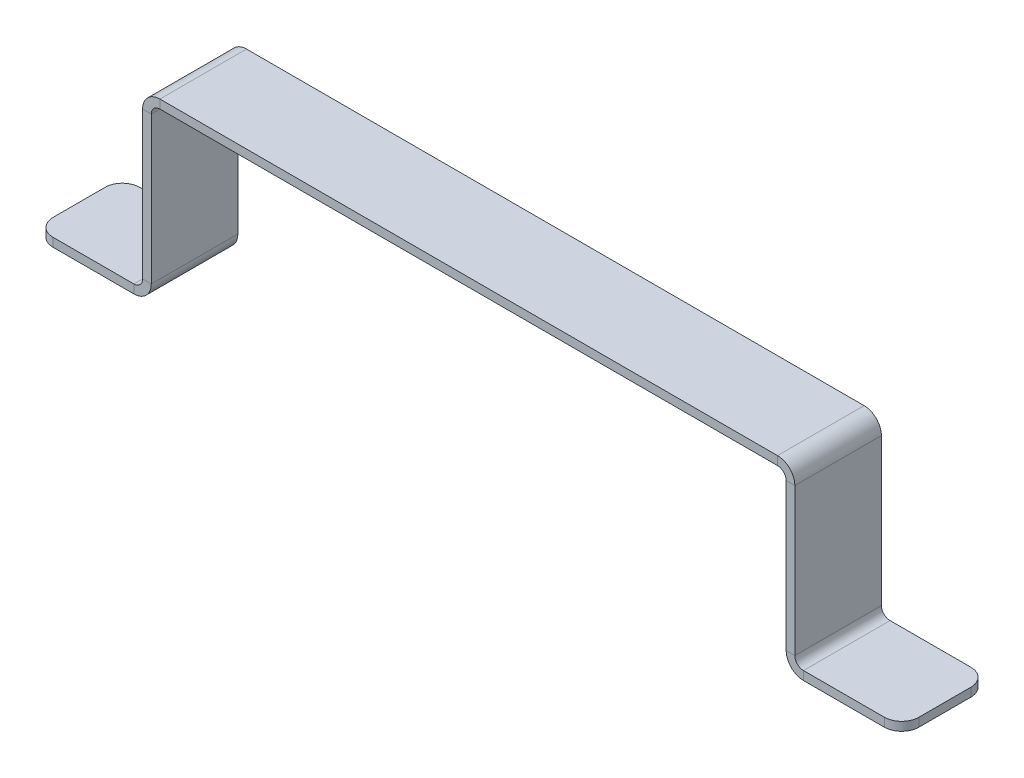
ISO-10303-21;
HEADER;
FILE_DESCRIPTION(('STEP AP214'),'2;1');
FILE_NAME('part.step','',(''),(''),'','','');
FILE_SCHEMA(('AUTOMOTIVE_DESIGN { 1 0 10303 214 1 1 1 1 }'));
ENDSEC;
DATA;
#1=APPLICATION_CONTEXT('core data for automotive mechanical design processes');
#2=APPLICATION_PROTOCOL_DEFINITION('international standard','automotive_design',2000,#1);
#3=PRODUCT_CONTEXT('',#1,'mechanical');
#4=PRODUCT('Part','Part','',(#3));
#5=PRODUCT_RELATED_PRODUCT_CATEGORY('part','',(#4));
#6=PRODUCT_DEFINITION_FORMATION('','',#4);
#7=PRODUCT_DEFINITION_CONTEXT('part definition',#1,'design');
#8=PRODUCT_DEFINITION('design','',#6,#7);
#9=PRODUCT_DEFINITION_SHAPE('','',#8);
#10=(LENGTH_UNIT() NAMED_UNIT(*) SI_UNIT(.MILLI.,.METRE.));
#11=(NAMED_UNIT(*) PLANE_ANGLE_UNIT() SI_UNIT($,.RADIAN.));
#12=(NAMED_UNIT(*) SI_UNIT($,.STERADIAN.) SOLID_ANGLE_UNIT());
#13=UNCERTAINTY_MEASURE_WITH_UNIT(LENGTH_MEASURE(1.E-05),#10,'distance_accuracy_value','');
#14=(GEOMETRIC_REPRESENTATION_CONTEXT(3) GLOBAL_UNCERTAINTY_ASSIGNED_CONTEXT((#13)) GLOBAL_UNIT_ASSIGNED_CONTEXT((#10,
#11,#12)) REPRESENTATION_CONTEXT('',''));
#15=CARTESIAN_POINT('',(0.,0.,0.));
#16=DIRECTION('',(0.,0.,1.));
#17=DIRECTION('',(1.,0.,0.));
#18=AXIS2_PLACEMENT_3D('',#15,#16,#17);
#19=CARTESIAN_POINT('',(-58.,0.,7.5));
#20=DIRECTION('',(0.,0.,1.));
#21=DIRECTION('',(1.,0.,0.));
#22=AXIS2_PLACEMENT_3D('',#19,#20,#21);
#23=PLANE('',#22);
#24=DIRECTION('',(0.,1.,0.));
#25=VECTOR('',#24,1.);
#26=CARTESIAN_POINT('',(-58.,0.,7.5));
#27=LINE('',#26,#25);
#28=CARTESIAN_POINT('',(-58.,0.,7.5));
#29=VERTEX_POINT('',#28);
#30=CARTESIAN_POINT('',(-58.,1.5,7.5));
#31=VERTEX_POINT('',#30);
#32=EDGE_CURVE('E198',#29,#31,#27,.T.);
#33=ORIENTED_EDGE('',*,*,#32,.F.);
#34=CARTESIAN_POINT('',(-58.,3.,7.5));
#35=DIRECTION('',(0.,0.,-1.));
#36=DIRECTION('',(-1.,0.,0.));
#37=AXIS2_PLACEMENT_3D('',#34,#35,#36);
#38=CIRCLE('',#37,3.);
#39=CARTESIAN_POINT('',(-55.,3.,7.5));
#40=VERTEX_POINT('',#39);
#41=EDGE_CURVE('E201',#40,#29,#38,.T.);
#42=ORIENTED_EDGE('',*,*,#41,.F.);
#43=DIRECTION('',(1.,0.,0.));
#44=VECTOR('',#43,1.);
#45=CARTESIAN_POINT('',(-56.5,3.,7.5));
#46=LINE('',#45,#44);
#47=CARTESIAN_POINT('',(-56.5,3.,7.5));
#48=VERTEX_POINT('',#47);
#49=EDGE_CURVE('E207',#48,#40,#46,.T.);
#50=ORIENTED_EDGE('',*,*,#49,.F.);
#51=CARTESIAN_POINT('',(-58.,3.,7.5));
#52=DIRECTION('',(0.,0.,1.));
#53=DIRECTION('',(1.,0.,0.));
#54=AXIS2_PLACEMENT_3D('',#51,#52,#53);
#55=CIRCLE('',#54,1.5);
#56=EDGE_CURVE('E204',#48,#31,#55,.F.);
#57=ORIENTED_EDGE('',*,*,#56,.T.);
#58=EDGE_LOOP('',(#33,#42,#50,#57));
#59=FACE_BOUND('',#58,.T.);
#60=ADVANCED_FACE('F35',(#59),#23,.T.);
#61=CARTESIAN_POINT('',(-56.5,3.,7.5));
#62=DIRECTION('',(0.,0.,1.));
#63=DIRECTION('',(1.,0.,0.));
#64=AXIS2_PLACEMENT_3D('',#61,#62,#63);
#65=PLANE('',#64);
#66=DIRECTION('',(1.,0.,0.));
#67=VECTOR('',#66,1.);
#68=CARTESIAN_POINT('',(-75.,1.5,7.5));
#69=LINE('',#68,#67);
#70=CARTESIAN_POINT('',(-72.,1.5,7.5));
#71=VERTEX_POINT('',#70);
#72=EDGE_CURVE('E225',#31,#71,#69,.F.);
#73=ORIENTED_EDGE('',*,*,#72,.T.);
#74=DIRECTION('',(0.,1.,0.));
#75=VECTOR('',#74,1.);
#76=CARTESIAN_POINT('',(-72.,3.,7.5));
#77=LINE('',#76,#75);
#78=CARTESIAN_POINT('',(-72.,0.,7.5));
#79=VERTEX_POINT('',#78);
#80=EDGE_CURVE('E11',#71,#79,#77,.F.);
#81=ORIENTED_EDGE('',*,*,#80,.T.);
#82=DIRECTION('',(-1.,0.,0.));
#83=VECTOR('',#82,1.);
#84=CARTESIAN_POINT('',(-75.,0.,7.5));
#85=LINE('',#84,#83);
#86=EDGE_CURVE('E214',#29,#79,#85,.T.);
#87=ORIENTED_EDGE('',*,*,#86,.F.);
#88=ORIENTED_EDGE('',*,*,#32,.T.);
#89=EDGE_LOOP('',(#73,#81,#87,#88));
#90=FACE_BOUND('',#89,.T.);
#91=ADVANCED_FACE('F224',(#90),#65,.T.);
#92=CARTESIAN_POINT('',(-55.,3.,-7.5));
#93=DIRECTION('',(0.,0.,-1.));
#94=DIRECTION('',(-1.,0.,0.));
#95=AXIS2_PLACEMENT_3D('',#92,#93,#94);
#96=PLANE('',#95);
#97=DIRECTION('',(-1.,0.,0.));
#98=VECTOR('',#97,1.);
#99=CARTESIAN_POINT('',(-55.,3.,-7.5));
#100=LINE('',#99,#98);
#101=CARTESIAN_POINT('',(-55.,3.,-7.5));
#102=VERTEX_POINT('',#101);
#103=CARTESIAN_POINT('',(-56.5,3.,-7.5));
#104=VERTEX_POINT('',#103);
#105=EDGE_CURVE('E402',#102,#104,#100,.T.);
#106=ORIENTED_EDGE('',*,*,#105,.F.);
#107=CARTESIAN_POINT('',(-58.,3.,-7.5));
#108=DIRECTION('',(0.,0.,-1.));
#109=DIRECTION('',(-1.,0.,0.));
#110=AXIS2_PLACEMENT_3D('',#107,#108,#109);
#111=CIRCLE('',#110,3.);
#112=CARTESIAN_POINT('',(-58.,0.,-7.5));
#113=VERTEX_POINT('',#112);
#114=EDGE_CURVE('E278',#102,#113,#111,.T.);
#115=ORIENTED_EDGE('',*,*,#114,.T.);
#116=DIRECTION('',(0.,-1.,0.));
#117=VECTOR('',#116,1.);
#118=CARTESIAN_POINT('',(-58.,1.5,-7.5));
#119=LINE('',#118,#117);
#120=CARTESIAN_POINT('',(-58.,1.5,-7.5));
#121=VERTEX_POINT('',#120);
#122=EDGE_CURVE('E400',#121,#113,#119,.T.);
#123=ORIENTED_EDGE('',*,*,#122,.F.);
#124=CARTESIAN_POINT('',(-58.,3.,-7.5));
#125=DIRECTION('',(0.,0.,1.));
#126=DIRECTION('',(1.,0.,0.));
#127=AXIS2_PLACEMENT_3D('',#124,#125,#126);
#128=CIRCLE('',#127,1.5);
#129=EDGE_CURVE('E320',#104,#121,#128,.F.);
#130=ORIENTED_EDGE('',*,*,#129,.F.);
#131=EDGE_LOOP('',(#106,#115,#123,#130));
#132=FACE_BOUND('',#131,.T.);
#133=ADVANCED_FACE('F453',(#132),#96,.T.);
#134=CARTESIAN_POINT('',(-58.,1.5,-7.5));
#135=DIRECTION('',(0.,0.,-1.));
#136=DIRECTION('',(-1.,0.,0.));
#137=AXIS2_PLACEMENT_3D('',#134,#135,#136);
#138=PLANE('',#137);
#139=DIRECTION('',(0.,-1.,0.));
#140=VECTOR('',#139,1.);
#141=CARTESIAN_POINT('',(-55.,0.,-7.5));
#142=LINE('',#141,#140);
#143=CARTESIAN_POINT('',(-55.,28.5,-7.5));
#144=VERTEX_POINT('',#143);
#145=EDGE_CURVE('E280',#144,#102,#142,.T.);
#146=ORIENTED_EDGE('',*,*,#145,.T.);
#147=ORIENTED_EDGE('',*,*,#105,.T.);
#148=DIRECTION('',(0.,1.,0.));
#149=VECTOR('',#148,1.);
#150=CARTESIAN_POINT('',(-56.5,0.,-7.5));
#151=LINE('',#150,#149);
#152=CARTESIAN_POINT('',(-56.5,28.5,-7.5));
#153=VERTEX_POINT('',#152);
#154=EDGE_CURVE('E317',#153,#104,#151,.F.);
#155=ORIENTED_EDGE('',*,*,#154,.F.);
#156=DIRECTION('',(1.,0.,0.));
#157=VECTOR('',#156,1.);
#158=CARTESIAN_POINT('',(-56.5,28.5,-7.5));
#159=LINE('',#158,#157);
#160=EDGE_CURVE('E392',#153,#144,#159,.T.);
#161=ORIENTED_EDGE('',*,*,#160,.T.);
#162=EDGE_LOOP('',(#146,#147,#155,#161));
#163=FACE_BOUND('',#162,.T.);
#164=ADVANCED_FACE('F456',(#163),#138,.T.);
#165=CARTESIAN_POINT('',(-55.,28.5,7.5));
#166=DIRECTION('',(0.,0.,1.));
#167=DIRECTION('',(1.,0.,0.));
#168=AXIS2_PLACEMENT_3D('',#165,#166,#167);
#169=PLANE('',#168);
#170=DIRECTION('',(-1.,0.,0.));
#171=VECTOR('',#170,1.);
#172=CARTESIAN_POINT('',(-55.,28.5,7.5));
#173=LINE('',#172,#171);
#174=CARTESIAN_POINT('',(-55.,28.5,7.5));
#175=VERTEX_POINT('',#174);
#176=CARTESIAN_POINT('',(-56.5,28.5,7.5));
#177=VERTEX_POINT('',#176);
#178=EDGE_CURVE('E398',#175,#177,#173,.T.);
#179=ORIENTED_EDGE('',*,*,#178,.F.);
#180=CARTESIAN_POINT('',(-53.5,28.5,7.5));
#181=DIRECTION('',(0.,0.,1.));
#182=DIRECTION('',(1.,0.,0.));
#183=AXIS2_PLACEMENT_3D('',#180,#181,#182);
#184=CIRCLE('',#183,1.5);
#185=CARTESIAN_POINT('',(-53.5,30.,7.5));
#186=VERTEX_POINT('',#185);
#187=EDGE_CURVE('E232',#186,#175,#184,.T.);
#188=ORIENTED_EDGE('',*,*,#187,.F.);
#189=DIRECTION('',(0.,-1.,0.));
#190=VECTOR('',#189,1.);
#191=CARTESIAN_POINT('',(-53.5,31.5,7.5));
#192=LINE('',#191,#190);
#193=CARTESIAN_POINT('',(-53.5,31.5,7.5));
#194=VERTEX_POINT('',#193);
#195=EDGE_CURVE('E396',#194,#186,#192,.T.);
#196=ORIENTED_EDGE('',*,*,#195,.F.);
#197=CARTESIAN_POINT('',(-53.5,28.5,7.5));
#198=DIRECTION('',(0.,0.,1.));
#199=DIRECTION('',(1.,0.,0.));
#200=AXIS2_PLACEMENT_3D('',#197,#198,#199);
#201=CIRCLE('',#200,3.);
#202=EDGE_CURVE('E266',#194,#177,#201,.T.);
#203=ORIENTED_EDGE('',*,*,#202,.T.);
#204=EDGE_LOOP('',(#179,#188,#196,#203));
#205=FACE_BOUND('',#204,.T.);
#206=ADVANCED_FACE('F522',(#205),#169,.T.);
#207=CARTESIAN_POINT('',(-53.5,31.5,7.5));
#208=DIRECTION('',(0.,0.,1.));
#209=DIRECTION('',(1.,0.,0.));
#210=AXIS2_PLACEMENT_3D('',#207,#208,#209);
#211=PLANE('',#210);
#212=DIRECTION('',(0.,-1.,0.));
#213=VECTOR('',#212,1.);
#214=CARTESIAN_POINT('',(-55.,0.,7.5));
#215=LINE('',#214,#213);
#216=EDGE_CURVE('E230',#175,#40,#215,.T.);
#217=ORIENTED_EDGE('',*,*,#216,.F.);
#218=ORIENTED_EDGE('',*,*,#178,.T.);
#219=DIRECTION('',(0.,1.,0.));
#220=VECTOR('',#219,1.);
#221=CARTESIAN_POINT('',(-56.5,0.,7.5));
#222=LINE('',#221,#220);
#223=EDGE_CURVE('E269',#177,#48,#222,.F.);
#224=ORIENTED_EDGE('',*,*,#223,.T.);
#225=ORIENTED_EDGE('',*,*,#49,.T.);
#226=EDGE_LOOP('',(#217,#218,#224,#225));
#227=FACE_BOUND('',#226,.T.);
#228=ADVANCED_FACE('F526',(#227),#211,.T.);
#229=CARTESIAN_POINT('',(-53.5,30.,-7.5));
#230=DIRECTION('',(0.,0.,-1.));
#231=DIRECTION('',(-1.,0.,0.));
#232=AXIS2_PLACEMENT_3D('',#229,#230,#231);
#233=PLANE('',#232);
#234=DIRECTION('',(0.,1.,0.));
#235=VECTOR('',#234,1.);
#236=CARTESIAN_POINT('',(-53.5,30.,-7.5));
#237=LINE('',#236,#235);
#238=CARTESIAN_POINT('',(-53.5,30.,-7.5));
#239=VERTEX_POINT('',#238);
#240=CARTESIAN_POINT('',(-53.5,31.5,-7.5));
#241=VERTEX_POINT('',#240);
#242=EDGE_CURVE('E394',#239,#241,#237,.T.);
#243=ORIENTED_EDGE('',*,*,#242,.F.);
#244=CARTESIAN_POINT('',(-53.5,28.5,-7.5));
#245=DIRECTION('',(0.,0.,1.));
#246=DIRECTION('',(1.,0.,0.));
#247=AXIS2_PLACEMENT_3D('',#244,#245,#246);
#248=CIRCLE('',#247,1.5);
#249=EDGE_CURVE('E283',#239,#144,#248,.T.);
#250=ORIENTED_EDGE('',*,*,#249,.T.);
#251=ORIENTED_EDGE('',*,*,#160,.F.);
#252=CARTESIAN_POINT('',(-53.5,28.5,-7.5));
#253=DIRECTION('',(0.,0.,1.));
#254=DIRECTION('',(1.,0.,0.));
#255=AXIS2_PLACEMENT_3D('',#252,#253,#254);
#256=CIRCLE('',#255,3.);
#257=EDGE_CURVE('E314',#241,#153,#256,.T.);
#258=ORIENTED_EDGE('',*,*,#257,.F.);
#259=EDGE_LOOP('',(#243,#250,#251,#258));
#260=FACE_BOUND('',#259,.T.);
#261=ADVANCED_FACE('F464',(#260),#233,.T.);
#262=CARTESIAN_POINT('',(-56.5,28.5,-7.5));
#263=DIRECTION('',(0.,0.,-1.));
#264=DIRECTION('',(-1.,0.,0.));
#265=AXIS2_PLACEMENT_3D('',#262,#263,#264);
#266=PLANE('',#265);
#267=DIRECTION('',(-1.,0.,0.));
#268=VECTOR('',#267,1.);
#269=CARTESIAN_POINT('',(-55.,30.,-7.5));
#270=LINE('',#269,#268);
#271=CARTESIAN_POINT('',(53.5,30.,-7.5));
#272=VERTEX_POINT('',#271);
#273=EDGE_CURVE('E286',#272,#239,#270,.T.);
#274=ORIENTED_EDGE('',*,*,#273,.T.);
#275=ORIENTED_EDGE('',*,*,#242,.T.);
#276=DIRECTION('',(1.,0.,0.));
#277=VECTOR('',#276,1.);
#278=CARTESIAN_POINT('',(-55.,31.5,-7.5));
#279=LINE('',#278,#277);
#280=CARTESIAN_POINT('',(53.5,31.5,-7.5));
#281=VERTEX_POINT('',#280);
#282=EDGE_CURVE('E311',#281,#241,#279,.F.);
#283=ORIENTED_EDGE('',*,*,#282,.F.);
#284=DIRECTION('',(0.,-1.,0.));
#285=VECTOR('',#284,1.);
#286=CARTESIAN_POINT('',(53.5,31.5,-7.5));
#287=LINE('',#286,#285);
#288=EDGE_CURVE('E384',#281,#272,#287,.T.);
#289=ORIENTED_EDGE('',*,*,#288,.T.);
#290=EDGE_LOOP('',(#274,#275,#283,#289));
#291=FACE_BOUND('',#290,.T.);
#292=ADVANCED_FACE('F472',(#291),#266,.T.);
#293=CARTESIAN_POINT('',(53.5,30.,7.5));
#294=DIRECTION('',(0.,0.,1.));
#295=DIRECTION('',(1.,0.,0.));
#296=AXIS2_PLACEMENT_3D('',#293,#294,#295);
#297=PLANE('',#296);
#298=DIRECTION('',(0.,1.,0.));
#299=VECTOR('',#298,1.);
#300=CARTESIAN_POINT('',(53.5,30.,7.5));
#301=LINE('',#300,#299);
#302=CARTESIAN_POINT('',(53.5,30.,7.5));
#303=VERTEX_POINT('',#302);
#304=CARTESIAN_POINT('',(53.5,31.5,7.5));
#305=VERTEX_POINT('',#304);
#306=EDGE_CURVE('E390',#303,#305,#301,.T.);
#307=ORIENTED_EDGE('',*,*,#306,.F.);
#308=CARTESIAN_POINT('',(53.5,28.5,7.5));
#309=DIRECTION('',(0.,0.,1.));
#310=DIRECTION('',(1.,0.,0.));
#311=AXIS2_PLACEMENT_3D('',#308,#309,#310);
#312=CIRCLE('',#311,1.5);
#313=CARTESIAN_POINT('',(55.,28.5,7.5));
#314=VERTEX_POINT('',#313);
#315=EDGE_CURVE('E241',#314,#303,#312,.T.);
#316=ORIENTED_EDGE('',*,*,#315,.F.);
#317=DIRECTION('',(-1.,0.,0.));
#318=VECTOR('',#317,1.);
#319=CARTESIAN_POINT('',(56.5,28.5,7.5));
#320=LINE('',#319,#318);
#321=CARTESIAN_POINT('',(56.5,28.5,7.5));
#322=VERTEX_POINT('',#321);
#323=EDGE_CURVE('E388',#322,#314,#320,.T.);
#324=ORIENTED_EDGE('',*,*,#323,.F.);
#325=CARTESIAN_POINT('',(53.5,28.5,7.5));
#326=DIRECTION('',(0.,0.,1.));
#327=DIRECTION('',(1.,0.,0.));
#328=AXIS2_PLACEMENT_3D('',#325,#326,#327);
#329=CIRCLE('',#328,3.);
#330=EDGE_CURVE('E260',#322,#305,#329,.T.);
#331=ORIENTED_EDGE('',*,*,#330,.T.);
#332=EDGE_LOOP('',(#307,#316,#324,#331));
#333=FACE_BOUND('',#332,.T.);
#334=ADVANCED_FACE('F514',(#333),#297,.T.);
#335=CARTESIAN_POINT('',(56.5,28.5,7.5));
#336=DIRECTION('',(0.,0.,1.));
#337=DIRECTION('',(1.,0.,0.));
#338=AXIS2_PLACEMENT_3D('',#335,#336,#337);
#339=PLANE('',#338);
#340=DIRECTION('',(-1.,0.,0.));
#341=VECTOR('',#340,1.);
#342=CARTESIAN_POINT('',(-55.,30.,7.5));
#343=LINE('',#342,#341);
#344=EDGE_CURVE('E238',#303,#186,#343,.T.);
#345=ORIENTED_EDGE('',*,*,#344,.F.);
#346=ORIENTED_EDGE('',*,*,#306,.T.);
#347=DIRECTION('',(1.,0.,0.));
#348=VECTOR('',#347,1.);
#349=CARTESIAN_POINT('',(-55.,31.5,7.5));
#350=LINE('',#349,#348);
#351=EDGE_CURVE('E263',#305,#194,#350,.F.);
#352=ORIENTED_EDGE('',*,*,#351,.T.);
#353=ORIENTED_EDGE('',*,*,#195,.T.);
#354=EDGE_LOOP('',(#345,#346,#352,#353));
#355=FACE_BOUND('',#354,.T.);
#356=ADVANCED_FACE('F518',(#355),#339,.T.);
#357=CARTESIAN_POINT('',(55.,28.5,-7.5));
#358=DIRECTION('',(0.,0.,-1.));
#359=DIRECTION('',(-1.,0.,0.));
#360=AXIS2_PLACEMENT_3D('',#357,#358,#359);
#361=PLANE('',#360);
#362=DIRECTION('',(1.,0.,0.));
#363=VECTOR('',#362,1.);
#364=CARTESIAN_POINT('',(55.,28.5,-7.5));
#365=LINE('',#364,#363);
#366=CARTESIAN_POINT('',(55.,28.5,-7.5));
#367=VERTEX_POINT('',#366);
#368=CARTESIAN_POINT('',(56.5,28.5,-7.5));
#369=VERTEX_POINT('',#368);
#370=EDGE_CURVE('E386',#367,#369,#365,.T.);
#371=ORIENTED_EDGE('',*,*,#370,.F.);
#372=CARTESIAN_POINT('',(53.5,28.5,-7.5));
#373=DIRECTION('',(0.,0.,1.));
#374=DIRECTION('',(1.,0.,0.));
#375=AXIS2_PLACEMENT_3D('',#372,#373,#374);
#376=CIRCLE('',#375,1.5);
#377=EDGE_CURVE('E289',#367,#272,#376,.T.);
#378=ORIENTED_EDGE('',*,*,#377,.T.);
#379=ORIENTED_EDGE('',*,*,#288,.F.);
#380=CARTESIAN_POINT('',(53.5,28.5,-7.5));
#381=DIRECTION('',(0.,0.,1.));
#382=DIRECTION('',(1.,0.,0.));
#383=AXIS2_PLACEMENT_3D('',#380,#381,#382);
#384=CIRCLE('',#383,3.);
#385=EDGE_CURVE('E308',#369,#281,#384,.T.);
#386=ORIENTED_EDGE('',*,*,#385,.F.);
#387=EDGE_LOOP('',(#371,#378,#379,#386));
#388=FACE_BOUND('',#387,.T.);
#389=ADVANCED_FACE('F480',(#388),#361,.T.);
#390=CARTESIAN_POINT('',(53.5,31.5,-7.5));
#391=DIRECTION('',(0.,0.,-1.));
#392=DIRECTION('',(-1.,0.,0.));
#393=AXIS2_PLACEMENT_3D('',#390,#391,#392);
#394=PLANE('',#393);
#395=DIRECTION('',(0.,1.,0.));
#396=VECTOR('',#395,1.);
#397=CARTESIAN_POINT('',(55.,0.,-7.5));
#398=LINE('',#397,#396);
#399=CARTESIAN_POINT('',(55.,3.,-7.5));
#400=VERTEX_POINT('',#399);
#401=EDGE_CURVE('E292',#400,#367,#398,.T.);
#402=ORIENTED_EDGE('',*,*,#401,.T.);
#403=ORIENTED_EDGE('',*,*,#370,.T.);
#404=DIRECTION('',(0.,1.,0.));
#405=VECTOR('',#404,1.);
#406=CARTESIAN_POINT('',(56.5,0.,-7.5));
#407=LINE('',#406,#405);
#408=CARTESIAN_POINT('',(56.5,3.,-7.5));
#409=VERTEX_POINT('',#408);
#410=EDGE_CURVE('E305',#409,#369,#407,.T.);
#411=ORIENTED_EDGE('',*,*,#410,.F.);
#412=DIRECTION('',(-1.,0.,0.));
#413=VECTOR('',#412,1.);
#414=CARTESIAN_POINT('',(56.5,3.,-7.5));
#415=LINE('',#414,#413);
#416=EDGE_CURVE('E374',#409,#400,#415,.T.);
#417=ORIENTED_EDGE('',*,*,#416,.T.);
#418=EDGE_LOOP('',(#402,#403,#411,#417));
#419=FACE_BOUND('',#418,.T.);
#420=ADVANCED_FACE('F488',(#419),#394,.T.);
#421=CARTESIAN_POINT('',(55.,3.,7.5));
#422=DIRECTION('',(0.,0.,1.));
#423=DIRECTION('',(1.,0.,0.));
#424=AXIS2_PLACEMENT_3D('',#421,#422,#423);
#425=PLANE('',#424);
#426=DIRECTION('',(1.,0.,0.));
#427=VECTOR('',#426,1.);
#428=CARTESIAN_POINT('',(55.,3.,7.5));
#429=LINE('',#428,#427);
#430=CARTESIAN_POINT('',(55.,3.,7.5));
#431=VERTEX_POINT('',#430);
#432=CARTESIAN_POINT('',(56.5,3.,7.5));
#433=VERTEX_POINT('',#432);
#434=EDGE_CURVE('E382',#431,#433,#429,.T.);
#435=ORIENTED_EDGE('',*,*,#434,.F.);
#436=CARTESIAN_POINT('',(58.,3.,7.5));
#437=DIRECTION('',(0.,0.,-1.));
#438=DIRECTION('',(-1.,0.,0.));
#439=AXIS2_PLACEMENT_3D('',#436,#437,#438);
#440=CIRCLE('',#439,3.);
#441=CARTESIAN_POINT('',(58.,0.,7.5));
#442=VERTEX_POINT('',#441);
#443=EDGE_CURVE('E247',#442,#431,#440,.T.);
#444=ORIENTED_EDGE('',*,*,#443,.F.);
#445=DIRECTION('',(0.,-1.,0.));
#446=VECTOR('',#445,1.);
#447=CARTESIAN_POINT('',(58.,1.5,7.5));
#448=LINE('',#447,#446);
#449=CARTESIAN_POINT('',(58.,1.5,7.5));
#450=VERTEX_POINT('',#449);
#451=EDGE_CURVE('E379',#450,#442,#448,.T.);
#452=ORIENTED_EDGE('',*,*,#451,.F.);
#453=CARTESIAN_POINT('',(58.,3.,7.5));
#454=DIRECTION('',(0.,0.,1.));
#455=DIRECTION('',(1.,0.,0.));
#456=AXIS2_PLACEMENT_3D('',#453,#454,#455);
#457=CIRCLE('',#456,1.5);
#458=EDGE_CURVE('E254',#450,#433,#457,.F.);
#459=ORIENTED_EDGE('',*,*,#458,.T.);
#460=EDGE_LOOP('',(#435,#444,#452,#459));
#461=FACE_BOUND('',#460,.T.);
#462=ADVANCED_FACE('F505',(#461),#425,.T.);
#463=CARTESIAN_POINT('',(58.,1.5,7.5));
#464=DIRECTION('',(0.,0.,1.));
#465=DIRECTION('',(1.,0.,0.));
#466=AXIS2_PLACEMENT_3D('',#463,#464,#465);
#467=PLANE('',#466);
#468=DIRECTION('',(0.,1.,0.));
#469=VECTOR('',#468,1.);
#470=CARTESIAN_POINT('',(55.,0.,7.5));
#471=LINE('',#470,#469);
#472=EDGE_CURVE('E244',#431,#314,#471,.T.);
#473=ORIENTED_EDGE('',*,*,#472,.F.);
#474=ORIENTED_EDGE('',*,*,#434,.T.);
#475=DIRECTION('',(0.,1.,0.));
#476=VECTOR('',#475,1.);
#477=CARTESIAN_POINT('',(56.5,0.,7.5));
#478=LINE('',#477,#476);
#479=EDGE_CURVE('E257',#433,#322,#478,.T.);
#480=ORIENTED_EDGE('',*,*,#479,.T.);
#481=ORIENTED_EDGE('',*,*,#323,.T.);
#482=EDGE_LOOP('',(#473,#474,#480,#481));
#483=FACE_BOUND('',#482,.T.);
#484=ADVANCED_FACE('F510',(#483),#467,.T.);
#485=CARTESIAN_POINT('',(58.,0.,-7.5));
#486=DIRECTION('',(0.,0.,-1.));
#487=DIRECTION('',(-1.,0.,0.));
#488=AXIS2_PLACEMENT_3D('',#485,#486,#487);
#489=PLANE('',#488);
#490=DIRECTION('',(0.,1.,0.));
#491=VECTOR('',#490,1.);
#492=CARTESIAN_POINT('',(58.,0.,-7.5));
#493=LINE('',#492,#491);
#494=CARTESIAN_POINT('',(58.,0.,-7.5));
#495=VERTEX_POINT('',#494);
#496=CARTESIAN_POINT('',(58.,1.5,-7.5));
#497=VERTEX_POINT('',#496);
#498=EDGE_CURVE('E376',#495,#497,#493,.T.);
#499=ORIENTED_EDGE('',*,*,#498,.F.);
#500=CARTESIAN_POINT('',(58.,3.,-7.5));
#501=DIRECTION('',(0.,0.,-1.));
#502=DIRECTION('',(-1.,0.,0.));
#503=AXIS2_PLACEMENT_3D('',#500,#501,#502);
#504=CIRCLE('',#503,3.);
#505=EDGE_CURVE('E295',#495,#400,#504,.T.);
#506=ORIENTED_EDGE('',*,*,#505,.T.);
#507=ORIENTED_EDGE('',*,*,#416,.F.);
#508=CARTESIAN_POINT('',(58.,3.,-7.5));
#509=DIRECTION('',(0.,0.,1.));
#510=DIRECTION('',(1.,0.,0.));
#511=AXIS2_PLACEMENT_3D('',#508,#509,#510);
#512=CIRCLE('',#511,1.5);
#513=EDGE_CURVE('E302',#497,#409,#512,.F.);
#514=ORIENTED_EDGE('',*,*,#513,.F.);
#515=EDGE_LOOP('',(#499,#506,#507,#514));
#516=FACE_BOUND('',#515,.T.);
#517=ADVANCED_FACE('F497',(#516),#489,.T.);
#518=CARTESIAN_POINT('',(56.5,3.,-7.5));
#519=DIRECTION('',(0.,0.,-1.));
#520=DIRECTION('',(-1.,0.,0.));
#521=AXIS2_PLACEMENT_3D('',#518,#519,#520);
#522=PLANE('',#521);
#523=DIRECTION('',(1.,0.,0.));
#524=VECTOR('',#523,1.);
#525=CARTESIAN_POINT('',(75.,1.5,-7.5));
#526=LINE('',#525,#524);
#527=CARTESIAN_POINT('',(72.,1.5,-7.5));
#528=VERTEX_POINT('',#527);
#529=EDGE_CURVE('E300',#528,#497,#526,.F.);
#530=ORIENTED_EDGE('',*,*,#529,.F.);
#531=DIRECTION('',(0.,-1.,0.));
#532=VECTOR('',#531,1.);
#533=CARTESIAN_POINT('',(72.,3.,-7.5));
#534=LINE('',#533,#532);
#535=CARTESIAN_POINT('',(72.,0.,-7.5));
#536=VERTEX_POINT('',#535);
#537=EDGE_CURVE('E419',#528,#536,#534,.T.);
#538=ORIENTED_EDGE('',*,*,#537,.T.);
#539=DIRECTION('',(-1.,0.,0.));
#540=VECTOR('',#539,1.);
#541=CARTESIAN_POINT('',(75.,0.,-7.5));
#542=LINE('',#541,#540);
#543=EDGE_CURVE('E298',#536,#495,#542,.T.);
#544=ORIENTED_EDGE('',*,*,#543,.T.);
#545=ORIENTED_EDGE('',*,*,#498,.T.);
#546=EDGE_LOOP('',(#530,#538,#544,#545));
#547=FACE_BOUND('',#546,.T.);
#548=ADVANCED_FACE('F548',(#547),#522,.T.);
#549=CARTESIAN_POINT('',(-75.,1.5,7.5));
#550=DIRECTION('',(0.,-1.,0.));
#551=DIRECTION('',(0.,0.,-1.));
#552=AXIS2_PLACEMENT_3D('',#549,#550,#551);
#553=PLANE('',#552);
#554=DIRECTION('',(1.,0.,0.));
#555=VECTOR('',#554,1.);
#556=CARTESIAN_POINT('',(-75.,1.5,-7.5));
#557=LINE('',#556,#555);
#558=CARTESIAN_POINT('',(-72.,1.5,-7.5));
#559=VERTEX_POINT('',#558);
#560=EDGE_CURVE('E274',#121,#559,#557,.F.);
#561=ORIENTED_EDGE('',*,*,#560,.T.);
#562=CARTESIAN_POINT('',(-72.,1.5,-4.5));
#563=DIRECTION('',(0.,-1.,0.));
#564=DIRECTION('',(0.,0.,-1.));
#565=AXIS2_PLACEMENT_3D('',#562,#563,#564);
#566=CIRCLE('',#565,3.);
#567=CARTESIAN_POINT('',(-75.,1.5,-4.5));
#568=VERTEX_POINT('',#567);
#569=EDGE_CURVE('E427',#559,#568,#566,.F.);
#570=ORIENTED_EDGE('',*,*,#569,.T.);
#571=DIRECTION('',(0.,0.,-1.));
#572=VECTOR('',#571,1.);
#573=CARTESIAN_POINT('',(-75.,1.5,7.5));
#574=LINE('',#573,#572);
#575=CARTESIAN_POINT('',(-75.,1.5,4.5));
#576=VERTEX_POINT('',#575);
#577=EDGE_CURVE('E372',#576,#568,#574,.T.);
#578=ORIENTED_EDGE('',*,*,#577,.F.);
#579=CARTESIAN_POINT('',(-72.,1.5,4.5));
#580=DIRECTION('',(0.,-1.,0.));
#581=DIRECTION('',(0.,0.,-1.));
#582=AXIS2_PLACEMENT_3D('',#579,#580,#581);
#583=CIRCLE('',#582,3.);
#584=EDGE_CURVE('E425',#576,#71,#583,.F.);
#585=ORIENTED_EDGE('',*,*,#584,.T.);
#586=ORIENTED_EDGE('',*,*,#72,.F.);
#587=DIRECTION('',(0.,0.,-1.));
#588=VECTOR('',#587,1.);
#589=CARTESIAN_POINT('',(-58.,1.5,7.5));
#590=LINE('',#589,#588);
#591=EDGE_CURVE('E273',#31,#121,#590,.T.);
#592=ORIENTED_EDGE('',*,*,#591,.T.);
#593=EDGE_LOOP('',(#561,#570,#578,#585,#586,#592));
#594=FACE_BOUND('',#593,.T.);
#595=ADVANCED_FACE('F443',(#594),#553,.F.);
#596=CARTESIAN_POINT('',(-75.,0.,7.5));
#597=DIRECTION('',(-1.,0.,0.));
#598=DIRECTION('',(0.,0.,1.));
#599=AXIS2_PLACEMENT_3D('',#596,#597,#598);
#600=PLANE('',#599);
#601=ORIENTED_EDGE('',*,*,#577,.T.);
#602=DIRECTION('',(0.,1.,0.));
#603=VECTOR('',#602,1.);
#604=CARTESIAN_POINT('',(-75.,0.,-4.5));
#605=LINE('',#604,#603);
#606=CARTESIAN_POINT('',(-75.,0.,-4.5));
#607=VERTEX_POINT('',#606);
#608=EDGE_CURVE('E56',#568,#607,#605,.F.);
#609=ORIENTED_EDGE('',*,*,#608,.T.);
#610=DIRECTION('',(0.,0.,-1.));
#611=VECTOR('',#610,1.);
#612=CARTESIAN_POINT('',(-75.,0.,7.5));
#613=LINE('',#612,#611);
#614=CARTESIAN_POINT('',(-75.,0.,4.5));
#615=VERTEX_POINT('',#614);
#616=EDGE_CURVE('E221',#615,#607,#613,.T.);
#617=ORIENTED_EDGE('',*,*,#616,.F.);
#618=DIRECTION('',(0.,1.,0.));
#619=VECTOR('',#618,1.);
#620=CARTESIAN_POINT('',(-75.,0.,4.5));
#621=LINE('',#620,#619);
#622=EDGE_CURVE('E429',#615,#576,#621,.T.);
#623=ORIENTED_EDGE('',*,*,#622,.T.);
#624=EDGE_LOOP('',(#601,#609,#617,#623));
#625=FACE_BOUND('',#624,.T.);
#626=ADVANCED_FACE('F444',(#625),#600,.T.);
#627=CARTESIAN_POINT('',(-75.,0.,7.5));
#628=DIRECTION('',(0.,-1.,0.));
#629=DIRECTION('',(0.,0.,-1.));
#630=AXIS2_PLACEMENT_3D('',#627,#628,#629);
#631=PLANE('',#630);
#632=ORIENTED_EDGE('',*,*,#616,.T.);
#633=CARTESIAN_POINT('',(-72.,0.,-4.5));
#634=DIRECTION('',(0.,-1.,0.));
#635=DIRECTION('',(0.,0.,-1.));
#636=AXIS2_PLACEMENT_3D('',#633,#634,#635);
#637=CIRCLE('',#636,3.);
#638=CARTESIAN_POINT('',(-72.,0.,-7.5));
#639=VERTEX_POINT('',#638);
#640=EDGE_CURVE('E43',#607,#639,#637,.T.);
#641=ORIENTED_EDGE('',*,*,#640,.T.);
#642=DIRECTION('',(-1.,0.,0.));
#643=VECTOR('',#642,1.);
#644=CARTESIAN_POINT('',(-75.,0.,-7.5));
#645=LINE('',#644,#643);
#646=EDGE_CURVE('E217',#113,#639,#645,.T.);
#647=ORIENTED_EDGE('',*,*,#646,.F.);
#648=DIRECTION('',(0.,0.,-1.));
#649=VECTOR('',#648,1.);
#650=CARTESIAN_POINT('',(-58.,0.,7.5));
#651=LINE('',#650,#649);
#652=EDGE_CURVE('E212',#29,#113,#651,.T.);
#653=ORIENTED_EDGE('',*,*,#652,.F.);
#654=ORIENTED_EDGE('',*,*,#86,.T.);
#655=CARTESIAN_POINT('',(-72.,0.,4.5));
#656=DIRECTION('',(0.,-1.,0.));
#657=DIRECTION('',(0.,0.,-1.));
#658=AXIS2_PLACEMENT_3D('',#655,#656,#657);
#659=CIRCLE('',#658,3.);
#660=EDGE_CURVE('E433',#79,#615,#659,.T.);
#661=ORIENTED_EDGE('',*,*,#660,.T.);
#662=EDGE_LOOP('',(#632,#641,#647,#653,#654,#661));
#663=FACE_BOUND('',#662,.T.);
#664=ADVANCED_FACE('F213',(#663),#631,.T.);
#665=CARTESIAN_POINT('',(-58.,3.,7.5));
#666=DIRECTION('',(0.,0.,-1.));
#667=DIRECTION('',(-1.,0.,0.));
#668=AXIS2_PLACEMENT_3D('',#665,#666,#667);
#669=CYLINDRICAL_SURFACE('',#668,3.);
#670=ORIENTED_EDGE('',*,*,#114,.F.);
#671=DIRECTION('',(0.,0.,-1.));
#672=VECTOR('',#671,1.);
#673=CARTESIAN_POINT('',(-55.,3.,7.5));
#674=LINE('',#673,#672);
#675=EDGE_CURVE('E222',#40,#102,#674,.T.);
#676=ORIENTED_EDGE('',*,*,#675,.F.);
#677=ORIENTED_EDGE('',*,*,#41,.T.);
#678=ORIENTED_EDGE('',*,*,#652,.T.);
#679=EDGE_LOOP('',(#670,#676,#677,#678));
#680=FACE_BOUND('',#679,.T.);
#681=ADVANCED_FACE('F228',(#680),#669,.T.);
#682=CARTESIAN_POINT('',(-55.,0.,7.5));
#683=DIRECTION('',(1.,0.,0.));
#684=DIRECTION('',(0.,0.,-1.));
#685=AXIS2_PLACEMENT_3D('',#682,#683,#684);
#686=PLANE('',#685);
#687=ORIENTED_EDGE('',*,*,#145,.F.);
#688=DIRECTION('',(0.,0.,-1.));
#689=VECTOR('',#688,1.);
#690=CARTESIAN_POINT('',(-55.,28.5,7.5));
#691=LINE('',#690,#689);
#692=EDGE_CURVE('E367',#175,#144,#691,.T.);
#693=ORIENTED_EDGE('',*,*,#692,.F.);
#694=ORIENTED_EDGE('',*,*,#216,.T.);
#695=ORIENTED_EDGE('',*,*,#675,.T.);
#696=EDGE_LOOP('',(#687,#693,#694,#695));
#697=FACE_BOUND('',#696,.T.);
#698=ADVANCED_FACE('F460',(#697),#686,.T.);
#699=CARTESIAN_POINT('',(-53.5,28.5,7.5));
#700=DIRECTION('',(0.,0.,-1.));
#701=DIRECTION('',(-1.,0.,0.));
#702=AXIS2_PLACEMENT_3D('',#699,#700,#701);
#703=CYLINDRICAL_SURFACE('',#702,1.5);
#704=ORIENTED_EDGE('',*,*,#249,.F.);
#705=DIRECTION('',(0.,0.,-1.));
#706=VECTOR('',#705,1.);
#707=CARTESIAN_POINT('',(-53.5,30.,7.5));
#708=LINE('',#707,#706);
#709=EDGE_CURVE('E364',#186,#239,#708,.T.);
#710=ORIENTED_EDGE('',*,*,#709,.F.);
#711=ORIENTED_EDGE('',*,*,#187,.T.);
#712=ORIENTED_EDGE('',*,*,#692,.T.);
#713=EDGE_LOOP('',(#704,#710,#711,#712));
#714=FACE_BOUND('',#713,.T.);
#715=ADVANCED_FACE('F468',(#714),#703,.F.);
#716=CARTESIAN_POINT('',(-55.,30.,7.5));
#717=DIRECTION('',(0.,-1.,0.));
#718=DIRECTION('',(0.,0.,-1.));
#719=AXIS2_PLACEMENT_3D('',#716,#717,#718);
#720=PLANE('',#719);
#721=ORIENTED_EDGE('',*,*,#273,.F.);
#722=DIRECTION('',(0.,0.,-1.));
#723=VECTOR('',#722,1.);
#724=CARTESIAN_POINT('',(53.5,30.,7.5));
#725=LINE('',#724,#723);
#726=EDGE_CURVE('E361',#303,#272,#725,.T.);
#727=ORIENTED_EDGE('',*,*,#726,.F.);
#728=ORIENTED_EDGE('',*,*,#344,.T.);
#729=ORIENTED_EDGE('',*,*,#709,.T.);
#730=EDGE_LOOP('',(#721,#727,#728,#729));
#731=FACE_BOUND('',#730,.T.);
#732=ADVANCED_FACE('F476',(#731),#720,.T.);
#733=CARTESIAN_POINT('',(53.5,28.5,7.5));
#734=DIRECTION('',(0.,0.,-1.));
#735=DIRECTION('',(-1.,0.,0.));
#736=AXIS2_PLACEMENT_3D('',#733,#734,#735);
#737=CYLINDRICAL_SURFACE('',#736,1.5);
#738=ORIENTED_EDGE('',*,*,#377,.F.);
#739=DIRECTION('',(0.,0.,-1.));
#740=VECTOR('',#739,1.);
#741=CARTESIAN_POINT('',(55.,28.5,7.5));
#742=LINE('',#741,#740);
#743=EDGE_CURVE('E358',#314,#367,#742,.T.);
#744=ORIENTED_EDGE('',*,*,#743,.F.);
#745=ORIENTED_EDGE('',*,*,#315,.T.);
#746=ORIENTED_EDGE('',*,*,#726,.T.);
#747=EDGE_LOOP('',(#738,#744,#745,#746));
#748=FACE_BOUND('',#747,.T.);
#749=ADVANCED_FACE('F484',(#748),#737,.F.);
#750=CARTESIAN_POINT('',(55.,0.,7.5));
#751=DIRECTION('',(-1.,0.,0.));
#752=DIRECTION('',(0.,0.,1.));
#753=AXIS2_PLACEMENT_3D('',#750,#751,#752);
#754=PLANE('',#753);
#755=ORIENTED_EDGE('',*,*,#401,.F.);
#756=DIRECTION('',(0.,0.,-1.));
#757=VECTOR('',#756,1.);
#758=CARTESIAN_POINT('',(55.,3.,7.5));
#759=LINE('',#758,#757);
#760=EDGE_CURVE('E355',#431,#400,#759,.T.);
#761=ORIENTED_EDGE('',*,*,#760,.F.);
#762=ORIENTED_EDGE('',*,*,#472,.T.);
#763=ORIENTED_EDGE('',*,*,#743,.T.);
#764=EDGE_LOOP('',(#755,#761,#762,#763));
#765=FACE_BOUND('',#764,.T.);
#766=ADVANCED_FACE('F492',(#765),#754,.T.);
#767=CARTESIAN_POINT('',(58.,3.,7.5));
#768=DIRECTION('',(0.,0.,-1.));
#769=DIRECTION('',(-1.,0.,0.));
#770=AXIS2_PLACEMENT_3D('',#767,#768,#769);
#771=CYLINDRICAL_SURFACE('',#770,3.);
#772=ORIENTED_EDGE('',*,*,#505,.F.);
#773=DIRECTION('',(0.,0.,-1.));
#774=VECTOR('',#773,1.);
#775=CARTESIAN_POINT('',(58.,0.,7.5));
#776=LINE('',#775,#774);
#777=EDGE_CURVE('E352',#442,#495,#776,.T.);
#778=ORIENTED_EDGE('',*,*,#777,.F.);
#779=ORIENTED_EDGE('',*,*,#443,.T.);
#780=ORIENTED_EDGE('',*,*,#760,.T.);
#781=EDGE_LOOP('',(#772,#778,#779,#780));
#782=FACE_BOUND('',#781,.T.);
#783=ADVANCED_FACE('F501',(#782),#771,.T.);
#784=CARTESIAN_POINT('',(75.,0.,7.5));
#785=DIRECTION('',(0.,-1.,0.));
#786=DIRECTION('',(0.,0.,-1.));
#787=AXIS2_PLACEMENT_3D('',#784,#785,#786);
#788=PLANE('',#787);
#789=DIRECTION('',(0.,0.,-1.));
#790=VECTOR('',#789,1.);
#791=CARTESIAN_POINT('',(75.,0.,7.5));
#792=LINE('',#791,#790);
#793=CARTESIAN_POINT('',(75.,0.,4.5));
#794=VERTEX_POINT('',#793);
#795=CARTESIAN_POINT('',(75.,0.,-4.5));
#796=VERTEX_POINT('',#795);
#797=EDGE_CURVE('E349',#794,#796,#792,.T.);
#798=ORIENTED_EDGE('',*,*,#797,.F.);
#799=CARTESIAN_POINT('',(72.,0.,4.5));
#800=DIRECTION('',(0.,-1.,0.));
#801=DIRECTION('',(0.,0.,-1.));
#802=AXIS2_PLACEMENT_3D('',#799,#800,#801);
#803=CIRCLE('',#802,3.);
#804=CARTESIAN_POINT('',(72.,0.,7.5));
#805=VERTEX_POINT('',#804);
#806=EDGE_CURVE('E411',#794,#805,#803,.T.);
#807=ORIENTED_EDGE('',*,*,#806,.T.);
#808=DIRECTION('',(-1.,0.,0.));
#809=VECTOR('',#808,1.);
#810=CARTESIAN_POINT('',(75.,0.,7.5));
#811=LINE('',#810,#809);
#812=EDGE_CURVE('E250',#805,#442,#811,.T.);
#813=ORIENTED_EDGE('',*,*,#812,.T.);
#814=ORIENTED_EDGE('',*,*,#777,.T.);
#815=ORIENTED_EDGE('',*,*,#543,.F.);
#816=CARTESIAN_POINT('',(72.,0.,-4.5));
#817=DIRECTION('',(0.,-1.,0.));
#818=DIRECTION('',(0.,0.,-1.));
#819=AXIS2_PLACEMENT_3D('',#816,#817,#818);
#820=CIRCLE('',#819,3.);
#821=EDGE_CURVE('E409',#536,#796,#820,.T.);
#822=ORIENTED_EDGE('',*,*,#821,.T.);
#823=EDGE_LOOP('',(#798,#807,#813,#814,#815,#822));
#824=FACE_BOUND('',#823,.T.);
#825=ADVANCED_FACE('F552',(#824),#788,.T.);
#826=CARTESIAN_POINT('',(75.,1.5,7.5));
#827=DIRECTION('',(1.,0.,0.));
#828=DIRECTION('',(0.,0.,-1.));
#829=AXIS2_PLACEMENT_3D('',#826,#827,#828);
#830=PLANE('',#829);
#831=DIRECTION('',(0.,0.,-1.));
#832=VECTOR('',#831,1.);
#833=CARTESIAN_POINT('',(75.,1.5,7.5));
#834=LINE('',#833,#832);
#835=CARTESIAN_POINT('',(75.,1.5,4.5));
#836=VERTEX_POINT('',#835);
#837=CARTESIAN_POINT('',(75.,1.5,-4.5));
#838=VERTEX_POINT('',#837);
#839=EDGE_CURVE('E346',#836,#838,#834,.T.);
#840=ORIENTED_EDGE('',*,*,#839,.F.);
#841=DIRECTION('',(0.,-1.,0.));
#842=VECTOR('',#841,1.);
#843=CARTESIAN_POINT('',(75.,0.,4.5));
#844=LINE('',#843,#842);
#845=EDGE_CURVE('E406',#836,#794,#844,.T.);
#846=ORIENTED_EDGE('',*,*,#845,.T.);
#847=ORIENTED_EDGE('',*,*,#797,.T.);
#848=DIRECTION('',(0.,-1.,0.));
#849=VECTOR('',#848,1.);
#850=CARTESIAN_POINT('',(75.,1.5,-4.5));
#851=LINE('',#850,#849);
#852=EDGE_CURVE('E206',#796,#838,#851,.F.);
#853=ORIENTED_EDGE('',*,*,#852,.T.);
#854=EDGE_LOOP('',(#840,#846,#847,#853));
#855=FACE_BOUND('',#854,.T.);
#856=ADVANCED_FACE('F562',(#855),#830,.T.);
#857=CARTESIAN_POINT('',(75.,1.5,7.5));
#858=DIRECTION('',(0.,-1.,0.));
#859=DIRECTION('',(0.,0.,-1.));
#860=AXIS2_PLACEMENT_3D('',#857,#858,#859);
#861=PLANE('',#860);
#862=DIRECTION('',(1.,0.,0.));
#863=VECTOR('',#862,1.);
#864=CARTESIAN_POINT('',(75.,1.5,7.5));
#865=LINE('',#864,#863);
#866=CARTESIAN_POINT('',(72.,1.5,7.5));
#867=VERTEX_POINT('',#866);
#868=EDGE_CURVE('E252',#867,#450,#865,.F.);
#869=ORIENTED_EDGE('',*,*,#868,.F.);
#870=CARTESIAN_POINT('',(72.,1.5,4.5));
#871=DIRECTION('',(0.,-1.,0.));
#872=DIRECTION('',(0.,0.,-1.));
#873=AXIS2_PLACEMENT_3D('',#870,#871,#872);
#874=CIRCLE('',#873,3.);
#875=EDGE_CURVE('E417',#867,#836,#874,.F.);
#876=ORIENTED_EDGE('',*,*,#875,.T.);
#877=ORIENTED_EDGE('',*,*,#839,.T.);
#878=CARTESIAN_POINT('',(72.,1.5,-4.5));
#879=DIRECTION('',(0.,-1.,0.));
#880=DIRECTION('',(0.,0.,-1.));
#881=AXIS2_PLACEMENT_3D('',#878,#879,#880);
#882=CIRCLE('',#881,3.);
#883=EDGE_CURVE('E415',#838,#528,#882,.F.);
#884=ORIENTED_EDGE('',*,*,#883,.T.);
#885=ORIENTED_EDGE('',*,*,#529,.T.);
#886=DIRECTION('',(0.,0.,-1.));
#887=VECTOR('',#886,1.);
#888=CARTESIAN_POINT('',(58.,1.5,7.5));
#889=LINE('',#888,#887);
#890=EDGE_CURVE('E343',#450,#497,#889,.T.);
#891=ORIENTED_EDGE('',*,*,#890,.F.);
#892=EDGE_LOOP('',(#869,#876,#877,#884,#885,#891));
#893=FACE_BOUND('',#892,.T.);
#894=ADVANCED_FACE('F542',(#893),#861,.F.);
#895=CARTESIAN_POINT('',(58.,3.,7.5));
#896=DIRECTION('',(0.,0.,-1.));
#897=DIRECTION('',(-1.,0.,0.));
#898=AXIS2_PLACEMENT_3D('',#895,#896,#897);
#899=CYLINDRICAL_SURFACE('',#898,1.5);
#900=ORIENTED_EDGE('',*,*,#513,.T.);
#901=DIRECTION('',(0.,0.,-1.));
#902=VECTOR('',#901,1.);
#903=CARTESIAN_POINT('',(56.5,3.,7.5));
#904=LINE('',#903,#902);
#905=EDGE_CURVE('E340',#433,#409,#904,.T.);
#906=ORIENTED_EDGE('',*,*,#905,.F.);
#907=ORIENTED_EDGE('',*,*,#458,.F.);
#908=ORIENTED_EDGE('',*,*,#890,.T.);
#909=EDGE_LOOP('',(#900,#906,#907,#908));
#910=FACE_BOUND('',#909,.T.);
#911=ADVANCED_FACE('F539',(#910),#899,.F.);
#912=CARTESIAN_POINT('',(56.5,0.,7.5));
#913=DIRECTION('',(-1.,0.,0.));
#914=DIRECTION('',(0.,0.,1.));
#915=AXIS2_PLACEMENT_3D('',#912,#913,#914);
#916=PLANE('',#915);
#917=ORIENTED_EDGE('',*,*,#410,.T.);
#918=DIRECTION('',(0.,0.,-1.));
#919=VECTOR('',#918,1.);
#920=CARTESIAN_POINT('',(56.5,28.5,7.5));
#921=LINE('',#920,#919);
#922=EDGE_CURVE('E337',#322,#369,#921,.T.);
#923=ORIENTED_EDGE('',*,*,#922,.F.);
#924=ORIENTED_EDGE('',*,*,#479,.F.);
#925=ORIENTED_EDGE('',*,*,#905,.T.);
#926=EDGE_LOOP('',(#917,#923,#924,#925));
#927=FACE_BOUND('',#926,.T.);
#928=ADVANCED_FACE('F537',(#927),#916,.F.);
#929=CARTESIAN_POINT('',(53.5,28.5,7.5));
#930=DIRECTION('',(0.,0.,-1.));
#931=DIRECTION('',(-1.,0.,0.));
#932=AXIS2_PLACEMENT_3D('',#929,#930,#931);
#933=CYLINDRICAL_SURFACE('',#932,3.);
#934=ORIENTED_EDGE('',*,*,#385,.T.);
#935=DIRECTION('',(0.,0.,-1.));
#936=VECTOR('',#935,1.);
#937=CARTESIAN_POINT('',(53.5,31.5,7.5));
#938=LINE('',#937,#936);
#939=EDGE_CURVE('E334',#305,#281,#938,.T.);
#940=ORIENTED_EDGE('',*,*,#939,.F.);
#941=ORIENTED_EDGE('',*,*,#330,.F.);
#942=ORIENTED_EDGE('',*,*,#922,.T.);
#943=EDGE_LOOP('',(#934,#940,#941,#942));
#944=FACE_BOUND('',#943,.T.);
#945=ADVANCED_FACE('F535',(#944),#933,.T.);
#946=CARTESIAN_POINT('',(-55.,31.5,7.5));
#947=DIRECTION('',(0.,-1.,0.));
#948=DIRECTION('',(0.,0.,-1.));
#949=AXIS2_PLACEMENT_3D('',#946,#947,#948);
#950=PLANE('',#949);
#951=ORIENTED_EDGE('',*,*,#282,.T.);
#952=DIRECTION('',(0.,0.,-1.));
#953=VECTOR('',#952,1.);
#954=CARTESIAN_POINT('',(-53.5,31.5,7.5));
#955=LINE('',#954,#953);
#956=EDGE_CURVE('E331',#194,#241,#955,.T.);
#957=ORIENTED_EDGE('',*,*,#956,.F.);
#958=ORIENTED_EDGE('',*,*,#351,.F.);
#959=ORIENTED_EDGE('',*,*,#939,.T.);
#960=EDGE_LOOP('',(#951,#957,#958,#959));
#961=FACE_BOUND('',#960,.T.);
#962=ADVANCED_FACE('F533',(#961),#950,.F.);
#963=CARTESIAN_POINT('',(-53.5,28.5,7.5));
#964=DIRECTION('',(0.,0.,-1.));
#965=DIRECTION('',(-1.,0.,0.));
#966=AXIS2_PLACEMENT_3D('',#963,#964,#965);
#967=CYLINDRICAL_SURFACE('',#966,3.);
#968=ORIENTED_EDGE('',*,*,#257,.T.);
#969=DIRECTION('',(0.,0.,-1.));
#970=VECTOR('',#969,1.);
#971=CARTESIAN_POINT('',(-56.5,28.5,7.5));
#972=LINE('',#971,#970);
#973=EDGE_CURVE('E328',#177,#153,#972,.T.);
#974=ORIENTED_EDGE('',*,*,#973,.F.);
#975=ORIENTED_EDGE('',*,*,#202,.F.);
#976=ORIENTED_EDGE('',*,*,#956,.T.);
#977=EDGE_LOOP('',(#968,#974,#975,#976));
#978=FACE_BOUND('',#977,.T.);
#979=ADVANCED_FACE('F531',(#978),#967,.T.);
#980=CARTESIAN_POINT('',(-56.5,0.,7.5));
#981=DIRECTION('',(1.,0.,0.));
#982=DIRECTION('',(0.,0.,-1.));
#983=AXIS2_PLACEMENT_3D('',#980,#981,#982);
#984=PLANE('',#983);
#985=ORIENTED_EDGE('',*,*,#154,.T.);
#986=DIRECTION('',(0.,0.,-1.));
#987=VECTOR('',#986,1.);
#988=CARTESIAN_POINT('',(-56.5,3.,7.5));
#989=LINE('',#988,#987);
#990=EDGE_CURVE('E325',#48,#104,#989,.T.);
#991=ORIENTED_EDGE('',*,*,#990,.F.);
#992=ORIENTED_EDGE('',*,*,#223,.F.);
#993=ORIENTED_EDGE('',*,*,#973,.T.);
#994=EDGE_LOOP('',(#985,#991,#992,#993));
#995=FACE_BOUND('',#994,.T.);
#996=ADVANCED_FACE('F529',(#995),#984,.F.);
#997=CARTESIAN_POINT('',(-58.,3.,7.5));
#998=DIRECTION('',(0.,0.,-1.));
#999=DIRECTION('',(-1.,0.,0.));
#1000=AXIS2_PLACEMENT_3D('',#997,#998,#999);
#1001=CYLINDRICAL_SURFACE('',#1000,1.5);
#1002=ORIENTED_EDGE('',*,*,#129,.T.);
#1003=ORIENTED_EDGE('',*,*,#591,.F.);
#1004=ORIENTED_EDGE('',*,*,#56,.F.);
#1005=ORIENTED_EDGE('',*,*,#990,.T.);
#1006=EDGE_LOOP('',(#1002,#1003,#1004,#1005));
#1007=FACE_BOUND('',#1006,.T.);
#1008=ADVANCED_FACE('F449',(#1007),#1001,.F.);
#1009=CARTESIAN_POINT('',(-58.,3.,7.5));
#1010=DIRECTION('',(0.,0.,-1.));
#1011=DIRECTION('',(-1.,0.,0.));
#1012=AXIS2_PLACEMENT_3D('',#1009,#1010,#1011);
#1013=PLANE('',#1012);
#1014=ORIENTED_EDGE('',*,*,#812,.F.);
#1015=DIRECTION('',(0.,-1.,0.));
#1016=VECTOR('',#1015,1.);
#1017=CARTESIAN_POINT('',(72.,1.5,7.5));
#1018=LINE('',#1017,#1016);
#1019=EDGE_CURVE('E413',#805,#867,#1018,.F.);
#1020=ORIENTED_EDGE('',*,*,#1019,.T.);
#1021=ORIENTED_EDGE('',*,*,#868,.T.);
#1022=ORIENTED_EDGE('',*,*,#451,.T.);
#1023=EDGE_LOOP('',(#1014,#1020,#1021,#1022));
#1024=FACE_BOUND('',#1023,.T.);
#1025=ADVANCED_FACE('F556',(#1024),#1013,.F.);
#1026=CARTESIAN_POINT('',(-58.,3.,-7.5));
#1027=DIRECTION('',(0.,0.,-1.));
#1028=DIRECTION('',(-1.,0.,0.));
#1029=AXIS2_PLACEMENT_3D('',#1026,#1027,#1028);
#1030=PLANE('',#1029);
#1031=ORIENTED_EDGE('',*,*,#646,.T.);
#1032=DIRECTION('',(0.,1.,0.));
#1033=VECTOR('',#1032,1.);
#1034=CARTESIAN_POINT('',(-72.,3.,-7.5));
#1035=LINE('',#1034,#1033);
#1036=EDGE_CURVE('E422',#639,#559,#1035,.T.);
#1037=ORIENTED_EDGE('',*,*,#1036,.T.);
#1038=ORIENTED_EDGE('',*,*,#560,.F.);
#1039=ORIENTED_EDGE('',*,*,#122,.T.);
#1040=EDGE_LOOP('',(#1031,#1037,#1038,#1039));
#1041=FACE_BOUND('',#1040,.T.);
#1042=ADVANCED_FACE('F438',(#1041),#1030,.T.);
#1043=CARTESIAN_POINT('',(72.,1.5,4.5));
#1044=DIRECTION('',(0.,1.,0.));
#1045=DIRECTION('',(0.,0.,1.));
#1046=AXIS2_PLACEMENT_3D('',#1043,#1044,#1045);
#1047=CYLINDRICAL_SURFACE('',#1046,3.);
#1048=ORIENTED_EDGE('',*,*,#875,.F.);
#1049=ORIENTED_EDGE('',*,*,#1019,.F.);
#1050=ORIENTED_EDGE('',*,*,#806,.F.);
#1051=ORIENTED_EDGE('',*,*,#845,.F.);
#1052=EDGE_LOOP('',(#1048,#1049,#1050,#1051));
#1053=FACE_BOUND('',#1052,.T.);
#1054=ADVANCED_FACE('F558',(#1053),#1047,.T.);
#1055=CARTESIAN_POINT('',(72.,3.,-4.5));
#1056=DIRECTION('',(0.,-1.,0.));
#1057=DIRECTION('',(0.,0.,-1.));
#1058=AXIS2_PLACEMENT_3D('',#1055,#1056,#1057);
#1059=CYLINDRICAL_SURFACE('',#1058,3.);
#1060=ORIENTED_EDGE('',*,*,#883,.F.);
#1061=ORIENTED_EDGE('',*,*,#852,.F.);
#1062=ORIENTED_EDGE('',*,*,#821,.F.);
#1063=ORIENTED_EDGE('',*,*,#537,.F.);
#1064=EDGE_LOOP('',(#1060,#1061,#1062,#1063));
#1065=FACE_BOUND('',#1064,.T.);
#1066=ADVANCED_FACE('F565',(#1065),#1059,.T.);
#1067=CARTESIAN_POINT('',(-72.,3.,-4.5));
#1068=DIRECTION('',(0.,1.,0.));
#1069=DIRECTION('',(0.,0.,1.));
#1070=AXIS2_PLACEMENT_3D('',#1067,#1068,#1069);
#1071=CYLINDRICAL_SURFACE('',#1070,3.);
#1072=ORIENTED_EDGE('',*,*,#640,.F.);
#1073=ORIENTED_EDGE('',*,*,#608,.F.);
#1074=ORIENTED_EDGE('',*,*,#569,.F.);
#1075=ORIENTED_EDGE('',*,*,#1036,.F.);
#1076=EDGE_LOOP('',(#1072,#1073,#1074,#1075));
#1077=FACE_BOUND('',#1076,.T.);
#1078=ADVANCED_FACE('F440',(#1077),#1071,.T.);
#1079=CARTESIAN_POINT('',(-72.,0.,4.5));
#1080=DIRECTION('',(0.,1.,0.));
#1081=DIRECTION('',(0.,0.,1.));
#1082=AXIS2_PLACEMENT_3D('',#1079,#1080,#1081);
#1083=CYLINDRICAL_SURFACE('',#1082,3.);
#1084=ORIENTED_EDGE('',*,*,#660,.F.);
#1085=ORIENTED_EDGE('',*,*,#80,.F.);
#1086=ORIENTED_EDGE('',*,*,#584,.F.);
#1087=ORIENTED_EDGE('',*,*,#622,.F.);
#1088=EDGE_LOOP('',(#1084,#1085,#1086,#1087));
#1089=FACE_BOUND('',#1088,.T.);
#1090=ADVANCED_FACE('F37',(#1089),#1083,.T.);
#1091=CLOSED_SHELL('',(#60,#91,#133,#164,#206,#228,#261,#292,#334,#356,#389,#420,#462,#484,#517,
#548,#595,#626,#664,#681,#698,#715,#732,#749,#766,#783,#825,#856,#894,#911,#928,#945,#962,#979,
#996,#1008,#1025,#1042,#1054,#1066,#1078,#1090));
#1092=MANIFOLD_SOLID_BREP('B2',#1091);
#1093=ADVANCED_BREP_SHAPE_REPRESENTATION('',(#18,#1092),#14);
#1094=SHAPE_DEFINITION_REPRESENTATION(#9,#1093);
ENDSEC;
END-ISO-10303-21;
